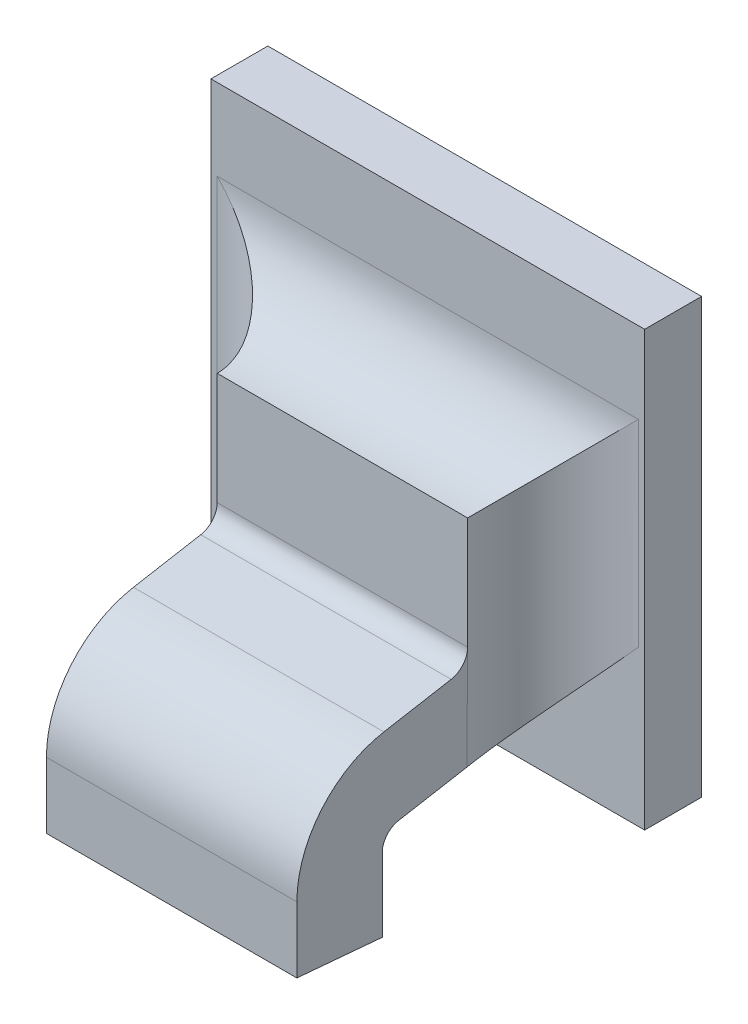
ISO-10303-21;
HEADER;
FILE_DESCRIPTION(('STEP AP214'),'2;1');
FILE_NAME('part.step','',(''),(''),'','','');
FILE_SCHEMA(('AUTOMOTIVE_DESIGN { 1 0 10303 214 1 1 1 1 }'));
ENDSEC;
DATA;
#1=APPLICATION_CONTEXT('core data for automotive mechanical design processes');
#2=APPLICATION_PROTOCOL_DEFINITION('international standard','automotive_design',2000,#1);
#3=PRODUCT_CONTEXT('',#1,'mechanical');
#4=PRODUCT('Part','Part','',(#3));
#5=PRODUCT_RELATED_PRODUCT_CATEGORY('part','',(#4));
#6=PRODUCT_DEFINITION_FORMATION('','',#4);
#7=PRODUCT_DEFINITION_CONTEXT('part definition',#1,'design');
#8=PRODUCT_DEFINITION('design','',#6,#7);
#9=PRODUCT_DEFINITION_SHAPE('','',#8);
#10=(LENGTH_UNIT() NAMED_UNIT(*) SI_UNIT(.MILLI.,.METRE.));
#11=(NAMED_UNIT(*) PLANE_ANGLE_UNIT() SI_UNIT($,.RADIAN.));
#12=(NAMED_UNIT(*) SI_UNIT($,.STERADIAN.) SOLID_ANGLE_UNIT());
#13=UNCERTAINTY_MEASURE_WITH_UNIT(LENGTH_MEASURE(1.E-05),#10,'distance_accuracy_value','');
#14=(GEOMETRIC_REPRESENTATION_CONTEXT(3) GLOBAL_UNCERTAINTY_ASSIGNED_CONTEXT((#13)) GLOBAL_UNIT_ASSIGNED_CONTEXT((#10,
#11,#12)) REPRESENTATION_CONTEXT('',''));
#15=CARTESIAN_POINT('',(0.,0.,0.));
#16=DIRECTION('',(0.,0.,1.));
#17=DIRECTION('',(1.,0.,0.));
#18=AXIS2_PLACEMENT_3D('',#15,#16,#17);
#19=CARTESIAN_POINT('',(0.822556400239721,-0.409025815001354,0.0757361902758917));
#20=DIRECTION('',(0.,0.984807753012208,0.17364817766693));
#21=DIRECTION('',(0.,-0.17364817766693,0.984807753012208));
#22=AXIS2_PLACEMENT_3D('',#19,#20,#21);
#23=PLANE('',#22);
#24=DIRECTION('',(0.,-0.1736481776671,0.984807753012178));
#25=VECTOR('',#24,1.);
#26=CARTESIAN_POINT('',(0.840745376617674,-0.409066843165544,0.0759688725575585));
#27=LINE('',#26,#25);
#28=CARTESIAN_POINT('',(0.840745376617674,-0.409066843165544,0.0759688725575584));
#29=VERTEX_POINT('',#28);
#30=CARTESIAN_POINT('',(0.840745376617674,-0.409887406449358,0.0806225181908947));
#31=VERTEX_POINT('',#30);
#32=EDGE_CURVE('E149',#29,#31,#27,.T.);
#33=ORIENTED_EDGE('',*,*,#32,.F.);
#34=DIRECTION('',(1.,0.,0.));
#35=VECTOR('',#34,1.);
#36=CARTESIAN_POINT('',(0.841611518349957,-0.409066843165544,0.0759688725575585));
#37=LINE('',#36,#35);
#38=CARTESIAN_POINT('',(0.823422541972004,-0.409066843165544,0.0759688725575584));
#39=VERTEX_POINT('',#38);
#40=EDGE_CURVE('E145',#29,#39,#37,.F.);
#41=ORIENTED_EDGE('',*,*,#40,.T.);
#42=DIRECTION('',(0.,-0.1736481776671,0.984807753012178));
#43=VECTOR('',#42,1.);
#44=CARTESIAN_POINT('',(0.823422541972004,-0.409066843165544,0.0759688725575585));
#45=LINE('',#44,#43);
#46=CARTESIAN_POINT('',(0.823422541972004,-0.409887406449358,0.0806225181908947));
#47=VERTEX_POINT('',#46);
#48=EDGE_CURVE('E187',#39,#47,#45,.T.);
#49=ORIENTED_EDGE('',*,*,#48,.T.);
#50=DIRECTION('',(1.,0.,0.));
#51=VECTOR('',#50,1.);
#52=CARTESIAN_POINT('',(0.841611518349957,-0.409887406449358,0.0806225181908942));
#53=LINE('',#52,#51);
#54=EDGE_CURVE('E228',#31,#47,#53,.F.);
#55=ORIENTED_EDGE('',*,*,#54,.F.);
#56=EDGE_LOOP('',(#33,#41,#49,#55));
#57=FACE_BOUND('',#56,.T.);
#58=ADVANCED_FACE('F17',(#57),#23,.T.);
#59=CARTESIAN_POINT('',(0.841611518349957,-0.417060218823659,0.0793577578417452));
#60=DIRECTION('',(1.,0.,0.));
#61=DIRECTION('',(0.,1.,0.));
#62=AXIS2_PLACEMENT_3D('',#59,#60,#61);
#63=CYLINDRICAL_SURFACE('',#62,0.00728346456692914);
#64=CARTESIAN_POINT('',(0.840745376617674,-0.417060218823659,0.0793577578417452));
#65=DIRECTION('',(1.,0.,0.));
#66=DIRECTION('',(0.,1.,0.));
#67=AXIS2_PLACEMENT_3D('',#64,#65,#66);
#68=CIRCLE('',#67,0.00728346456692914);
#69=CARTESIAN_POINT('',(0.840745376617674,-0.417060218823659,0.0866412224086743));
#70=VERTEX_POINT('',#69);
#71=EDGE_CURVE('E202',#31,#70,#68,.T.);
#72=ORIENTED_EDGE('',*,*,#71,.F.);
#73=ORIENTED_EDGE('',*,*,#54,.T.);
#74=CARTESIAN_POINT('',(0.823422541972004,-0.417060218823659,0.0793577578417452));
#75=DIRECTION('',(1.,0.,0.));
#76=DIRECTION('',(0.,1.,0.));
#77=AXIS2_PLACEMENT_3D('',#74,#75,#76);
#78=CIRCLE('',#77,0.00728346456692914);
#79=CARTESIAN_POINT('',(0.823422541972004,-0.417060218823659,0.0866412224086743));
#80=VERTEX_POINT('',#79);
#81=EDGE_CURVE('E184',#47,#80,#78,.T.);
#82=ORIENTED_EDGE('',*,*,#81,.T.);
#83=DIRECTION('',(1.,0.,0.));
#84=VECTOR('',#83,1.);
#85=CARTESIAN_POINT('',(0.822556400239721,-0.417060218823659,0.0866412224086743));
#86=LINE('',#85,#84);
#87=EDGE_CURVE('E224',#70,#80,#86,.F.);
#88=ORIENTED_EDGE('',*,*,#87,.F.);
#89=EDGE_LOOP('',(#72,#73,#82,#88));
#90=FACE_BOUND('',#89,.T.);
#91=ADVANCED_FACE('F278',(#90),#63,.T.);
#92=CARTESIAN_POINT('',(0.822556400239721,-0.416832209296573,0.0866412224086743));
#93=DIRECTION('',(0.,0.,1.));
#94=DIRECTION('',(0.,-1.,0.));
#95=AXIS2_PLACEMENT_3D('',#92,#93,#94);
#96=PLANE('',#95);
#97=ORIENTED_EDGE('',*,*,#87,.T.);
#98=DIRECTION('',(0.,1.,0.));
#99=VECTOR('',#98,1.);
#100=CARTESIAN_POINT('',(0.823422541972004,-0.422858437205813,0.0866412224086743));
#101=LINE('',#100,#99);
#102=CARTESIAN_POINT('',(0.823422541972004,-0.421620409365384,0.0866412224086743));
#103=VERTEX_POINT('',#102);
#104=EDGE_CURVE('E181',#80,#103,#101,.F.);
#105=ORIENTED_EDGE('',*,*,#104,.T.);
#106=DIRECTION('',(1.,0.,0.));
#107=VECTOR('',#106,1.);
#108=CARTESIAN_POINT('',(0.832083959294839,-0.421620409365383,0.0866412224086742));
#109=LINE('',#108,#107);
#110=CARTESIAN_POINT('',(0.840745376617674,-0.421620409365384,0.0866412224086743));
#111=VERTEX_POINT('',#110);
#112=EDGE_CURVE('E215',#103,#111,#109,.T.);
#113=ORIENTED_EDGE('',*,*,#112,.T.);
#114=DIRECTION('',(0.,1.,0.));
#115=VECTOR('',#114,1.);
#116=CARTESIAN_POINT('',(0.840745376617674,-0.422858437205813,0.0866412224086743));
#117=LINE('',#116,#115);
#118=EDGE_CURVE('E200',#70,#111,#117,.F.);
#119=ORIENTED_EDGE('',*,*,#118,.F.);
#120=EDGE_LOOP('',(#97,#105,#113,#119));
#121=FACE_BOUND('',#120,.T.);
#122=ADVANCED_FACE('F282',(#121),#96,.T.);
#123=CARTESIAN_POINT('',(0.832083959294839,-0.421652497123847,0.0862744576511551));
#124=DIRECTION('',(0.,0.99619469809174,-0.0871557427477276));
#125=DIRECTION('',(0.,0.0871557427477276,0.99619469809174));
#126=AXIS2_PLACEMENT_3D('',#123,#124,#125);
#127=PLANE('',#126);
#128=DIRECTION('',(0.,-0.0871557427476629,-0.996194698091745));
#129=VECTOR('',#128,1.);
#130=CARTESIAN_POINT('',(0.840745376617674,-0.421620409365384,0.0866412224086743));
#131=LINE('',#130,#129);
#132=CARTESIAN_POINT('',(0.840745376617674,-0.422137074701167,0.0807357105976507));
#133=VERTEX_POINT('',#132);
#134=EDGE_CURVE('E197',#111,#133,#131,.T.);
#135=ORIENTED_EDGE('',*,*,#134,.F.);
#136=ORIENTED_EDGE('',*,*,#112,.F.);
#137=DIRECTION('',(0.,-0.0871557427476629,-0.996194698091745));
#138=VECTOR('',#137,1.);
#139=CARTESIAN_POINT('',(0.823422541972004,-0.421620409365384,0.0866412224086743));
#140=LINE('',#139,#138);
#141=CARTESIAN_POINT('',(0.823422541972004,-0.422137074701167,0.0807357105976507));
#142=VERTEX_POINT('',#141);
#143=EDGE_CURVE('E178',#103,#142,#140,.T.);
#144=ORIENTED_EDGE('',*,*,#143,.T.);
#145=DIRECTION('',(1.,0.,0.));
#146=VECTOR('',#145,1.);
#147=CARTESIAN_POINT('',(0.822556400239721,-0.422137074701167,0.0807357105976507));
#148=LINE('',#147,#146);
#149=EDGE_CURVE('E212',#142,#133,#148,.T.);
#150=ORIENTED_EDGE('',*,*,#149,.T.);
#151=EDGE_LOOP('',(#135,#136,#144,#150));
#152=FACE_BOUND('',#151,.T.);
#153=ADVANCED_FACE('F286',(#152),#127,.F.);
#154=CARTESIAN_POINT('',(0.822556400239721,-0.416806376029784,0.0807357105976507));
#155=DIRECTION('',(0.,0.,1.));
#156=DIRECTION('',(0.,-1.,0.));
#157=AXIS2_PLACEMENT_3D('',#154,#155,#156);
#158=PLANE('',#157);
#159=ORIENTED_EDGE('',*,*,#149,.F.);
#160=DIRECTION('',(0.,1.,0.));
#161=VECTOR('',#160,1.);
#162=CARTESIAN_POINT('',(0.823422541972004,-0.422858437205813,0.0807357105976507));
#163=LINE('',#162,#161);
#164=CARTESIAN_POINT('',(0.823422541972004,-0.417060218823659,0.0807357105976507));
#165=VERTEX_POINT('',#164);
#166=EDGE_CURVE('E175',#142,#165,#163,.T.);
#167=ORIENTED_EDGE('',*,*,#166,.T.);
#168=DIRECTION('',(1.,0.,0.));
#169=VECTOR('',#168,1.);
#170=CARTESIAN_POINT('',(0.841611518349957,-0.417060218823659,0.0807357105976507));
#171=LINE('',#170,#169);
#172=CARTESIAN_POINT('',(0.840745376617674,-0.417060218823659,0.0807357105976507));
#173=VERTEX_POINT('',#172);
#174=EDGE_CURVE('E207',#165,#173,#171,.T.);
#175=ORIENTED_EDGE('',*,*,#174,.T.);
#176=DIRECTION('',(0.,1.,0.));
#177=VECTOR('',#176,1.);
#178=CARTESIAN_POINT('',(0.840745376617674,-0.422858437205813,0.0807357105976507));
#179=LINE('',#178,#177);
#180=EDGE_CURVE('E194',#133,#173,#179,.T.);
#181=ORIENTED_EDGE('',*,*,#180,.F.);
#182=EDGE_LOOP('',(#159,#167,#175,#181));
#183=FACE_BOUND('',#182,.T.);
#184=ADVANCED_FACE('F290',(#183),#158,.F.);
#185=CARTESIAN_POINT('',(0.841611518349957,-0.417060218823659,0.0793577578417452));
#186=DIRECTION('',(1.,0.,0.));
#187=DIRECTION('',(0.,1.,0.));
#188=AXIS2_PLACEMENT_3D('',#185,#186,#187);
#189=CYLINDRICAL_SURFACE('',#188,0.00137795275590551);
#190=DIRECTION('',(1.,0.,0.));
#191=VECTOR('',#190,1.);
#192=CARTESIAN_POINT('',(0.822556400239721,-0.415703200266359,0.0795970368267193));
#193=LINE('',#192,#191);
#194=CARTESIAN_POINT('',(0.823422541972004,-0.415703200266359,0.0795970368267193));
#195=VERTEX_POINT('',#194);
#196=CARTESIAN_POINT('',(0.840745376617674,-0.415703200266359,0.0795970368267193));
#197=VERTEX_POINT('',#196);
#198=EDGE_CURVE('E191',#195,#197,#193,.T.);
#199=ORIENTED_EDGE('',*,*,#198,.T.);
#200=CARTESIAN_POINT('',(0.840745376617674,-0.417060218823659,0.0793577578417452));
#201=DIRECTION('',(1.,0.,0.));
#202=DIRECTION('',(0.,1.,0.));
#203=AXIS2_PLACEMENT_3D('',#200,#201,#202);
#204=CIRCLE('',#203,0.00137795275590551);
#205=EDGE_CURVE('E196',#173,#197,#204,.F.);
#206=ORIENTED_EDGE('',*,*,#205,.F.);
#207=ORIENTED_EDGE('',*,*,#174,.F.);
#208=CARTESIAN_POINT('',(0.823422541972004,-0.417060218823659,0.0793577578417452));
#209=DIRECTION('',(1.,0.,0.));
#210=DIRECTION('',(0.,1.,0.));
#211=AXIS2_PLACEMENT_3D('',#208,#209,#210);
#212=CIRCLE('',#211,0.00137795275590551);
#213=EDGE_CURVE('E172',#165,#195,#212,.F.);
#214=ORIENTED_EDGE('',*,*,#213,.T.);
#215=EDGE_LOOP('',(#199,#206,#207,#214));
#216=FACE_BOUND('',#215,.T.);
#217=ADVANCED_FACE('F294',(#216),#189,.F.);
#218=CARTESIAN_POINT('',(0.841611518349957,-0.407709824608244,0.0762081515425326));
#219=DIRECTION('',(1.,0.,0.));
#220=DIRECTION('',(0.,1.,0.));
#221=AXIS2_PLACEMENT_3D('',#218,#219,#220);
#222=CYLINDRICAL_SURFACE('',#221,0.00137795275590552);
#223=ORIENTED_EDGE('',*,*,#40,.F.);
#224=CARTESIAN_POINT('',(0.840745376617674,-0.407709824608244,0.0762081515425326));
#225=DIRECTION('',(1.,0.,0.));
#226=DIRECTION('',(0.,1.,0.));
#227=AXIS2_PLACEMENT_3D('',#224,#225,#226);
#228=CIRCLE('',#227,0.00137795275590552);
#229=CARTESIAN_POINT('',(0.840745376617674,-0.407709824608244,0.0748301987866271));
#230=VERTEX_POINT('',#229);
#231=EDGE_CURVE('E20',#230,#29,#228,.F.);
#232=ORIENTED_EDGE('',*,*,#231,.F.);
#233=DIRECTION('',(1.,0.,0.));
#234=VECTOR('',#233,1.);
#235=CARTESIAN_POINT('',(0.822556400239721,-0.407709824608244,0.0748301987866271));
#236=LINE('',#235,#234);
#237=CARTESIAN_POINT('',(0.823422541972004,-0.407709824608244,0.0748301987866271));
#238=VERTEX_POINT('',#237);
#239=EDGE_CURVE('E127',#238,#230,#236,.T.);
#240=ORIENTED_EDGE('',*,*,#239,.F.);
#241=CARTESIAN_POINT('',(0.823422541972004,-0.407709824608244,0.0762081515425326));
#242=DIRECTION('',(1.,0.,0.));
#243=DIRECTION('',(0.,1.,0.));
#244=AXIS2_PLACEMENT_3D('',#241,#242,#243);
#245=CIRCLE('',#244,0.00137795275590552);
#246=EDGE_CURVE('E139',#238,#39,#245,.F.);
#247=ORIENTED_EDGE('',*,*,#246,.T.);
#248=EDGE_LOOP('',(#223,#232,#240,#247));
#249=FACE_BOUND('',#248,.T.);
#250=ADVANCED_FACE('F143',(#249),#222,.F.);
#251=CARTESIAN_POINT('',(0.840745376617674,-0.422858437205813,0.0742396476055247));
#252=DIRECTION('',(1.,0.,0.));
#253=DIRECTION('',(0.,1.,0.));
#254=AXIS2_PLACEMENT_3D('',#251,#252,#253);
#255=PLANE('',#254);
#256=ORIENTED_EDGE('',*,*,#205,.T.);
#257=DIRECTION('',(0.,-0.17364817766693,0.984807753012208));
#258=VECTOR('',#257,1.);
#259=CARTESIAN_POINT('',(0.840745376617674,-0.414841608818355,0.0747107089117169));
#260=LINE('',#259,#258);
#261=CARTESIAN_POINT('',(0.840745376617674,-0.414872195780549,0.0748867949900054));
#262=VERTEX_POINT('',#261);
#263=EDGE_CURVE('E162',#197,#262,#260,.F.);
#264=ORIENTED_EDGE('',*,*,#263,.T.);
#265=DIRECTION('',(0.,1.,0.));
#266=VECTOR('',#265,1.);
#267=CARTESIAN_POINT('',(0.840745376617673,-0.393021334230709,0.0748301987866271));
#268=LINE('',#267,#266);
#269=EDGE_CURVE('E138',#262,#230,#268,.T.);
#270=ORIENTED_EDGE('',*,*,#269,.T.);
#271=ORIENTED_EDGE('',*,*,#231,.T.);
#272=ORIENTED_EDGE('',*,*,#32,.T.);
#273=ORIENTED_EDGE('',*,*,#71,.T.);
#274=ORIENTED_EDGE('',*,*,#118,.T.);
#275=ORIENTED_EDGE('',*,*,#134,.T.);
#276=ORIENTED_EDGE('',*,*,#180,.T.);
#277=EDGE_LOOP('',(#256,#264,#270,#271,#272,#273,#274,#275,#276));
#278=FACE_BOUND('',#277,.T.);
#279=ADVANCED_FACE('F160',(#278),#255,.T.);
#280=CARTESIAN_POINT('',(0.822556400239721,-0.414841608818355,0.0747107089117169));
#281=DIRECTION('',(0.,0.984807753012208,0.17364817766693));
#282=DIRECTION('',(0.,-0.17364817766693,0.984807753012208));
#283=AXIS2_PLACEMENT_3D('',#280,#281,#282);
#284=PLANE('',#283);
#285=DIRECTION('',(1.,0.,0.));
#286=VECTOR('',#285,1.);
#287=CARTESIAN_POINT('',(0.848107581342083,-0.414882636982546,0.0749433911933838));
#288=LINE('',#287,#286);
#289=CARTESIAN_POINT('',(0.823422541972004,-0.414872195780549,0.0748867949900054));
#290=VERTEX_POINT('',#289);
#291=EDGE_CURVE('E243',#262,#290,#288,.F.);
#292=ORIENTED_EDGE('',*,*,#291,.F.);
#293=ORIENTED_EDGE('',*,*,#263,.F.);
#294=ORIENTED_EDGE('',*,*,#198,.F.);
#295=DIRECTION('',(0.,0.173648177666888,-0.984807753012215));
#296=VECTOR('',#295,1.);
#297=CARTESIAN_POINT('',(0.823422541972004,-0.415703200266359,0.0795970368267193));
#298=LINE('',#297,#296);
#299=EDGE_CURVE('E169',#195,#290,#298,.T.);
#300=ORIENTED_EDGE('',*,*,#299,.T.);
#301=EDGE_LOOP('',(#292,#293,#294,#300));
#302=FACE_BOUND('',#301,.T.);
#303=ADVANCED_FACE('F297',(#302),#284,.F.);
#304=CARTESIAN_POINT('',(0.823422541972004,-0.422858437205813,0.0742396476055247));
#305=DIRECTION('',(1.,0.,0.));
#306=DIRECTION('',(0.,1.,0.));
#307=AXIS2_PLACEMENT_3D('',#304,#305,#306);
#308=PLANE('',#307);
#309=DIRECTION('',(0.,-1.,0.));
#310=VECTOR('',#309,1.);
#311=CARTESIAN_POINT('',(0.823422541972005,-0.449179464483494,0.074830198786627));
#312=LINE('',#311,#310);
#313=EDGE_CURVE('E239',#238,#290,#312,.T.);
#314=ORIENTED_EDGE('',*,*,#313,.T.);
#315=ORIENTED_EDGE('',*,*,#299,.F.);
#316=ORIENTED_EDGE('',*,*,#213,.F.);
#317=ORIENTED_EDGE('',*,*,#166,.F.);
#318=ORIENTED_EDGE('',*,*,#143,.F.);
#319=ORIENTED_EDGE('',*,*,#104,.F.);
#320=ORIENTED_EDGE('',*,*,#81,.F.);
#321=ORIENTED_EDGE('',*,*,#48,.F.);
#322=ORIENTED_EDGE('',*,*,#246,.F.);
#323=EDGE_LOOP('',(#314,#315,#316,#317,#318,#319,#320,#321,#322));
#324=FACE_BOUND('',#323,.T.);
#325=ADVANCED_FACE('F300',(#324),#308,.F.);
#326=CARTESIAN_POINT('',(0.822556400239721,-0.3995797181308,0.0748301987866271));
#327=DIRECTION('',(0.,0.,1.));
#328=DIRECTION('',(0.,-1.,0.));
#329=AXIS2_PLACEMENT_3D('',#326,#327,#328);
#330=PLANE('',#329);
#331=DIRECTION('',(0.,1.,0.));
#332=VECTOR('',#331,1.);
#333=CARTESIAN_POINT('',(0.840745376617673,-0.393021334230709,0.0748301987866271));
#334=LINE('',#333,#332);
#335=CARTESIAN_POINT('',(0.840745376617673,-0.399966866058297,0.0748301987866271));
#336=VERTEX_POINT('',#335);
#337=EDGE_CURVE('E132',#230,#336,#334,.T.);
#338=ORIENTED_EDGE('',*,*,#337,.T.);
#339=DIRECTION('',(-1.,0.,0.));
#340=VECTOR('',#339,1.);
#341=CARTESIAN_POINT('',(0.816060337247595,-0.399966866058297,0.0748301987866271));
#342=LINE('',#341,#340);
#343=CARTESIAN_POINT('',(0.823422541972005,-0.399966866058297,0.0748301987866271));
#344=VERTEX_POINT('',#343);
#345=EDGE_CURVE('E237',#336,#344,#342,.T.);
#346=ORIENTED_EDGE('',*,*,#345,.T.);
#347=DIRECTION('',(0.,-1.,0.));
#348=VECTOR('',#347,1.);
#349=CARTESIAN_POINT('',(0.823422541972005,-0.449179464483494,0.074830198786627));
#350=LINE('',#349,#348);
#351=EDGE_CURVE('E134',#344,#238,#350,.T.);
#352=ORIENTED_EDGE('',*,*,#351,.T.);
#353=ORIENTED_EDGE('',*,*,#239,.T.);
#354=EDGE_LOOP('',(#338,#346,#352,#353));
#355=FACE_BOUND('',#354,.T.);
#356=ADVANCED_FACE('F129',(#355),#330,.T.);
#357=CARTESIAN_POINT('',(0.846650888428697,-0.393021334230709,0.0748301987866271));
#358=DIRECTION('',(0.,1.,0.));
#359=DIRECTION('',(-1.,0.,0.));
#360=AXIS2_PLACEMENT_3D('',#357,#358,#359);
#361=CYLINDRICAL_SURFACE('',#360,0.00590551181102362);
#362=DIRECTION('',(0.,-1.,0.));
#363=VECTOR('',#362,1.);
#364=CARTESIAN_POINT('',(0.846650888428697,-0.386950817143496,0.0689246869756034));
#365=LINE('',#364,#363);
#366=CARTESIAN_POINT('',(0.846650888428697,-0.394061354247273,0.0689246869756034));
#367=VERTEX_POINT('',#366);
#368=CARTESIAN_POINT('',(0.846650888428697,-0.407709824608244,0.0689246869756034));
#369=VERTEX_POINT('',#368);
#370=EDGE_CURVE('E236',#367,#369,#365,.T.);
#371=ORIENTED_EDGE('',*,*,#370,.F.);
#372=CARTESIAN_POINT('',(0.846650888428697,-0.394061354247273,0.0748301987866271));
#373=DIRECTION('',(-0.707106781186547,0.707106781186548,0.));
#374=DIRECTION('',(0.707106781186548,0.707106781186547,0.));
#375=AXIS2_PLACEMENT_3D('',#372,#373,#374);
#376=ELLIPSE('',#375,0.0083516548959041,0.00590551181102362);
#377=EDGE_CURVE('E156',#367,#336,#376,.T.);
#378=ORIENTED_EDGE('',*,*,#377,.T.);
#379=ORIENTED_EDGE('',*,*,#337,.F.);
#380=ORIENTED_EDGE('',*,*,#269,.F.);
#381=CARTESIAN_POINT('',(0.840745647396675,-0.414872418925753,0.0748867512278158));
#382=CARTESIAN_POINT('',(0.840742426597774,-0.414817534883798,0.0745867226896992));
#383=CARTESIAN_POINT('',(0.840762764717073,-0.414743102049647,0.0742912180435631));
#384=CARTESIAN_POINT('',(0.840843797330654,-0.414561218717932,0.0737192521976587));
#385=CARTESIAN_POINT('',(0.840904113821746,-0.414454082507667,0.073442639142952));
#386=CARTESIAN_POINT('',(0.841058198198209,-0.414212160110653,0.0729136983352979));
#387=CARTESIAN_POINT('',(0.841151824927203,-0.414077491604489,0.0726612737245141));
#388=CARTESIAN_POINT('',(0.841366072521191,-0.413785592919213,0.0721816323385189));
#389=CARTESIAN_POINT('',(0.841486762280983,-0.413628305532027,0.0719544821529173));
#390=CARTESIAN_POINT('',(0.841817110992378,-0.413210355493482,0.0714163132371127));
#391=CARTESIAN_POINT('',(0.842040521572931,-0.412938266512525,0.0711225918397621));
#392=CARTESIAN_POINT('',(0.842520298728847,-0.412366852005353,0.0705945092326559));
#393=CARTESIAN_POINT('',(0.842776741388518,-0.41206746408041,0.0703602888968061));
#394=CARTESIAN_POINT('',(0.843412248246951,-0.411334595021275,0.0698701186002405));
#395=CARTESIAN_POINT('',(0.843801168483127,-0.410893014396456,0.0696391000518475));
#396=CARTESIAN_POINT('',(0.844601142787128,-0.409991989295698,0.0692744135071735));
#397=CARTESIAN_POINT('',(0.845012181353002,-0.409532557392268,0.069140678258787));
#398=CARTESIAN_POINT('',(0.845713565203828,-0.408751184121972,0.0689922627689179));
#399=CARTESIAN_POINT('',(0.846001338597921,-0.408431306043267,0.0689533996467431));
#400=CARTESIAN_POINT('',(0.846410047822815,-0.407977291603917,0.0689283735464717));
#401=CARTESIAN_POINT('',(0.846530475434509,-0.407843550361138,0.0689246971321213));
#402=CARTESIAN_POINT('',(0.846650888428697,-0.407709824608244,0.0689246869756035));
#403=B_SPLINE_CURVE_WITH_KNOTS('',3,(#381,#382,#383,#384,#385,#386,#387,#388,#389,#390,#391,
#392,#393,#394,#395,#396,#397,#398,#399,#400,#401,#402),.UNSPECIFIED.,.F.,.F.,(4,2,2,2,2,2,2,2,
2,2,4),(0.,0.000911854640629307,0.00181520821824951,0.00271477844400083,0.00361666525652744,
0.00498448467541982,0.00635551296143176,0.0082419467971581,0.0101270752955223,
0.0114210586750924,0.0119609297477214),.UNSPECIFIED.);
#404=EDGE_CURVE('E157',#369,#262,#403,.F.);
#405=ORIENTED_EDGE('',*,*,#404,.F.);
#406=EDGE_LOOP('',(#371,#378,#379,#380,#405));
#407=FACE_BOUND('',#406,.T.);
#408=ADVANCED_FACE('F153',(#407),#361,.F.);
#409=CARTESIAN_POINT('',(0.848107581342083,-0.407709824608244,0.0762081515425326));
#410=DIRECTION('',(1.,0.,0.));
#411=DIRECTION('',(0.,1.,0.));
#412=AXIS2_PLACEMENT_3D('',#409,#410,#411);
#413=CYLINDRICAL_SURFACE('',#412,0.00728346456692914);
#414=ORIENTED_EDGE('',*,*,#404,.T.);
#415=ORIENTED_EDGE('',*,*,#291,.T.);
#416=CARTESIAN_POINT('',(0.823422271193003,-0.414872418925753,0.0748867512278158));
#417=CARTESIAN_POINT('',(0.823425491991904,-0.414817534883798,0.0745867226896991));
#418=CARTESIAN_POINT('',(0.823405153872605,-0.414743102049647,0.0742912180435631));
#419=CARTESIAN_POINT('',(0.823324121259024,-0.414561218717932,0.0737192521976587));
#420=CARTESIAN_POINT('',(0.823263804767932,-0.414454082507667,0.0734426391429519));
#421=CARTESIAN_POINT('',(0.823109720391469,-0.414212160110653,0.0729136983352979));
#422=CARTESIAN_POINT('',(0.823016093662476,-0.414077491604489,0.0726612737245141));
#423=CARTESIAN_POINT('',(0.822801846068487,-0.413785592919213,0.0721816323385189));
#424=CARTESIAN_POINT('',(0.822681156308695,-0.413628305532027,0.0719544821529173));
#425=CARTESIAN_POINT('',(0.8223508075973,-0.413210355493482,0.0714163132371128));
#426=CARTESIAN_POINT('',(0.822127397016747,-0.412938266512525,0.0711225918397621));
#427=CARTESIAN_POINT('',(0.821647619860831,-0.412366852005353,0.0705945092326559));
#428=CARTESIAN_POINT('',(0.82139117720116,-0.41206746408041,0.0703602888968061));
#429=CARTESIAN_POINT('',(0.820755670342727,-0.411334595021275,0.0698701186002404));
#430=CARTESIAN_POINT('',(0.820366750106551,-0.410893014396456,0.0696391000518475));
#431=CARTESIAN_POINT('',(0.81956677580255,-0.409991989295698,0.0692744135071735));
#432=CARTESIAN_POINT('',(0.819155737236676,-0.409532557392268,0.0691406782587869));
#433=CARTESIAN_POINT('',(0.81845435338585,-0.408751184121971,0.0689922627689179));
#434=CARTESIAN_POINT('',(0.818166579991758,-0.408431306043267,0.0689533996467431));
#435=CARTESIAN_POINT('',(0.817757870766864,-0.407977291603917,0.0689283735464716));
#436=CARTESIAN_POINT('',(0.817637443155169,-0.407843550361138,0.0689246971321213));
#437=CARTESIAN_POINT('',(0.817517030160981,-0.407709824608244,0.0689246869756034));
#438=B_SPLINE_CURVE_WITH_KNOTS('',3,(#416,#417,#418,#419,#420,#421,#422,#423,#424,#425,#426,
#427,#428,#429,#430,#431,#432,#433,#434,#435,#436,#437),.UNSPECIFIED.,.F.,.F.,(4,2,2,2,2,2,2,2,
2,2,4),(0.,0.000911854640629281,0.00181520821824949,0.00271477844400081,0.00361666525652741,
0.00498448467541974,0.0063555129614317,0.008241946797158,0.0101270752955222,0.0114210586750924,
0.0119609297477214),.UNSPECIFIED.);
#439=CARTESIAN_POINT('',(0.817517030160981,-0.407709824608244,0.0689246869756034));
#440=VERTEX_POINT('',#439);
#441=EDGE_CURVE('E240',#290,#440,#438,.T.);
#442=ORIENTED_EDGE('',*,*,#441,.T.);
#443=DIRECTION('',(1.,0.,0.));
#444=VECTOR('',#443,1.);
#445=CARTESIAN_POINT('',(0.815583959294839,-0.407709824608244,0.0689246869756034));
#446=LINE('',#445,#444);
#447=EDGE_CURVE('E310',#369,#440,#446,.F.);
#448=ORIENTED_EDGE('',*,*,#447,.F.);
#449=EDGE_LOOP('',(#414,#415,#442,#448));
#450=FACE_BOUND('',#449,.T.);
#451=ADVANCED_FACE('F255',(#450),#413,.T.);
#452=CARTESIAN_POINT('',(0.817517030160981,-0.449179464483494,0.074830198786627));
#453=DIRECTION('',(0.,-1.,0.));
#454=DIRECTION('',(1.,0.,0.));
#455=AXIS2_PLACEMENT_3D('',#452,#453,#454);
#456=CYLINDRICAL_SURFACE('',#455,0.00590551181102362);
#457=ORIENTED_EDGE('',*,*,#351,.F.);
#458=CARTESIAN_POINT('',(0.817517030160981,-0.394061354247273,0.0748301987866271));
#459=DIRECTION('',(-0.707106781186548,-0.707106781186547,0.));
#460=DIRECTION('',(0.707106781186547,-0.707106781186548,0.));
#461=AXIS2_PLACEMENT_3D('',#458,#459,#460);
#462=ELLIPSE('',#461,0.0083516548959041,0.00590551181102362);
#463=CARTESIAN_POINT('',(0.817517030160981,-0.394061354247273,0.0689246869756034));
#464=VERTEX_POINT('',#463);
#465=EDGE_CURVE('E233',#344,#464,#462,.F.);
#466=ORIENTED_EDGE('',*,*,#465,.T.);
#467=DIRECTION('',(0.,-1.,0.));
#468=VECTOR('',#467,1.);
#469=CARTESIAN_POINT('',(0.817517030160981,-0.386950817143496,0.0689246869756034));
#470=LINE('',#469,#468);
#471=EDGE_CURVE('E312',#440,#464,#470,.F.);
#472=ORIENTED_EDGE('',*,*,#471,.F.);
#473=ORIENTED_EDGE('',*,*,#441,.F.);
#474=ORIENTED_EDGE('',*,*,#313,.F.);
#475=EDGE_LOOP('',(#457,#466,#472,#473,#474));
#476=FACE_BOUND('',#475,.T.);
#477=ADVANCED_FACE('F252',(#476),#456,.F.);
#478=CARTESIAN_POINT('',(0.816060337247595,-0.394061354247273,0.0748301987866271));
#479=DIRECTION('',(-1.,0.,0.));
#480=DIRECTION('',(0.,-1.,0.));
#481=AXIS2_PLACEMENT_3D('',#478,#479,#480);
#482=CYLINDRICAL_SURFACE('',#481,0.00590551181102362);
#483=ORIENTED_EDGE('',*,*,#345,.F.);
#484=ORIENTED_EDGE('',*,*,#377,.F.);
#485=DIRECTION('',(1.,0.,0.));
#486=VECTOR('',#485,1.);
#487=CARTESIAN_POINT('',(0.815583959294839,-0.394061354247273,0.0689246869756034));
#488=LINE('',#487,#486);
#489=EDGE_CURVE('E320',#464,#367,#488,.T.);
#490=ORIENTED_EDGE('',*,*,#489,.F.);
#491=ORIENTED_EDGE('',*,*,#465,.F.);
#492=EDGE_LOOP('',(#483,#484,#490,#491));
#493=FACE_BOUND('',#492,.T.);
#494=ADVANCED_FACE('F382',(#493),#482,.F.);
#495=CARTESIAN_POINT('',(0.815583959294839,-0.386950817143496,0.0689246869756034));
#496=DIRECTION('',(0.,0.,1.));
#497=DIRECTION('',(0.,-1.,0.));
#498=AXIS2_PLACEMENT_3D('',#495,#496,#497);
#499=PLANE('',#498);
#500=ORIENTED_EDGE('',*,*,#471,.T.);
#501=ORIENTED_EDGE('',*,*,#489,.T.);
#502=ORIENTED_EDGE('',*,*,#370,.T.);
#503=ORIENTED_EDGE('',*,*,#447,.T.);
#504=EDGE_LOOP('',(#500,#501,#502,#503));
#505=FACE_BOUND('',#504,.T.);
#506=DIRECTION('',(0.,-1.,0.));
#507=VECTOR('',#506,1.);
#508=CARTESIAN_POINT('',(0.847083959294839,-0.386950817143496,0.0689246869756034));
#509=LINE('',#508,#507);
#510=CARTESIAN_POINT('',(0.847083959294839,-0.418450817143496,0.0689246869756034));
#511=VERTEX_POINT('',#510);
#512=CARTESIAN_POINT('',(0.847083959294839,-0.388450817143496,0.0689246869756034));
#513=VERTEX_POINT('',#512);
#514=EDGE_CURVE('E332',#511,#513,#509,.F.);
#515=ORIENTED_EDGE('',*,*,#514,.T.);
#516=DIRECTION('',(1.,0.,0.));
#517=VECTOR('',#516,1.);
#518=CARTESIAN_POINT('',(0.815583959294839,-0.388450817143496,0.0689246869756034));
#519=LINE('',#518,#517);
#520=CARTESIAN_POINT('',(0.817083959294839,-0.388450817143496,0.0689246869756034));
#521=VERTEX_POINT('',#520);
#522=EDGE_CURVE('E337',#513,#521,#519,.F.);
#523=ORIENTED_EDGE('',*,*,#522,.T.);
#524=DIRECTION('',(0.,1.,0.));
#525=VECTOR('',#524,1.);
#526=CARTESIAN_POINT('',(0.817083959294839,-0.419950817143496,0.0689246869756034));
#527=LINE('',#526,#525);
#528=CARTESIAN_POINT('',(0.817083959294839,-0.418450817143496,0.0689246869756034));
#529=VERTEX_POINT('',#528);
#530=EDGE_CURVE('E340',#521,#529,#527,.F.);
#531=ORIENTED_EDGE('',*,*,#530,.T.);
#532=DIRECTION('',(-1.,0.,0.));
#533=VECTOR('',#532,1.);
#534=CARTESIAN_POINT('',(0.848583959294839,-0.418450817143496,0.0689246869756034));
#535=LINE('',#534,#533);
#536=EDGE_CURVE('E324',#529,#511,#535,.F.);
#537=ORIENTED_EDGE('',*,*,#536,.T.);
#538=EDGE_LOOP('',(#515,#523,#531,#537));
#539=FACE_BOUND('',#538,.T.);
#540=ADVANCED_FACE('F317',(#505,#539),#499,.T.);
#541=CARTESIAN_POINT('',(0.848583959294839,-0.418450817143496,0.0647908287078869));
#542=DIRECTION('',(0.,1.,0.));
#543=DIRECTION('',(-1.,0.,0.));
#544=AXIS2_PLACEMENT_3D('',#541,#542,#543);
#545=PLANE('',#544);
#546=DIRECTION('',(0.,0.,1.));
#547=VECTOR('',#546,1.);
#548=CARTESIAN_POINT('',(0.847083959294839,-0.418450817143496,0.0647908287078869));
#549=LINE('',#548,#547);
#550=CARTESIAN_POINT('',(0.847083959294839,-0.418450817143496,0.0649876791015877));
#551=VERTEX_POINT('',#550);
#552=EDGE_CURVE('E325',#551,#511,#549,.T.);
#553=ORIENTED_EDGE('',*,*,#552,.T.);
#554=ORIENTED_EDGE('',*,*,#536,.F.);
#555=DIRECTION('',(0.,0.,1.));
#556=VECTOR('',#555,1.);
#557=CARTESIAN_POINT('',(0.817083959294839,-0.418450817143496,0.0647908287078869));
#558=LINE('',#557,#556);
#559=CARTESIAN_POINT('',(0.817083959294839,-0.418450817143496,0.0649876791015877));
#560=VERTEX_POINT('',#559);
#561=EDGE_CURVE('E343',#529,#560,#558,.F.);
#562=ORIENTED_EDGE('',*,*,#561,.T.);
#563=DIRECTION('',(1.,0.,0.));
#564=VECTOR('',#563,1.);
#565=CARTESIAN_POINT('',(0.815583959294839,-0.418450817143496,0.0649876791015877));
#566=LINE('',#565,#564);
#567=EDGE_CURVE('E346',#560,#551,#566,.T.);
#568=ORIENTED_EDGE('',*,*,#567,.T.);
#569=EDGE_LOOP('',(#553,#554,#562,#568));
#570=FACE_BOUND('',#569,.T.);
#571=ADVANCED_FACE('F364',(#570),#545,.F.);
#572=CARTESIAN_POINT('',(0.847083959294839,-0.386950817143496,0.0647908287078869));
#573=DIRECTION('',(-1.,0.,0.));
#574=DIRECTION('',(0.,-1.,0.));
#575=AXIS2_PLACEMENT_3D('',#572,#573,#574);
#576=PLANE('',#575);
#577=DIRECTION('',(0.,0.,1.));
#578=VECTOR('',#577,1.);
#579=CARTESIAN_POINT('',(0.847083959294839,-0.388450817143496,0.0647908287078869));
#580=LINE('',#579,#578);
#581=CARTESIAN_POINT('',(0.847083959294839,-0.388450817143496,0.0649876791015877));
#582=VERTEX_POINT('',#581);
#583=EDGE_CURVE('E334',#582,#513,#580,.T.);
#584=ORIENTED_EDGE('',*,*,#583,.T.);
#585=ORIENTED_EDGE('',*,*,#514,.F.);
#586=ORIENTED_EDGE('',*,*,#552,.F.);
#587=DIRECTION('',(0.,-1.,0.));
#588=VECTOR('',#587,1.);
#589=CARTESIAN_POINT('',(0.847083959294839,-0.386950817143496,0.0649876791015877));
#590=LINE('',#589,#588);
#591=EDGE_CURVE('E349',#551,#582,#590,.F.);
#592=ORIENTED_EDGE('',*,*,#591,.T.);
#593=EDGE_LOOP('',(#584,#585,#586,#592));
#594=FACE_BOUND('',#593,.T.);
#595=ADVANCED_FACE('F361',(#594),#576,.F.);
#596=CARTESIAN_POINT('',(0.815583959294839,-0.388450817143496,0.0647908287078869));
#597=DIRECTION('',(0.,-1.,0.));
#598=DIRECTION('',(1.,0.,0.));
#599=AXIS2_PLACEMENT_3D('',#596,#597,#598);
#600=PLANE('',#599);
#601=DIRECTION('',(0.,0.,1.));
#602=VECTOR('',#601,1.);
#603=CARTESIAN_POINT('',(0.817083959294839,-0.388450817143496,0.0647908287078869));
#604=LINE('',#603,#602);
#605=CARTESIAN_POINT('',(0.817083959294839,-0.388450817143496,0.0649876791015877));
#606=VERTEX_POINT('',#605);
#607=EDGE_CURVE('E34',#606,#521,#604,.T.);
#608=ORIENTED_EDGE('',*,*,#607,.T.);
#609=ORIENTED_EDGE('',*,*,#522,.F.);
#610=ORIENTED_EDGE('',*,*,#583,.F.);
#611=DIRECTION('',(1.,0.,0.));
#612=VECTOR('',#611,1.);
#613=CARTESIAN_POINT('',(0.815583959294839,-0.388450817143496,0.0649876791015877));
#614=LINE('',#613,#612);
#615=EDGE_CURVE('E26',#582,#606,#614,.F.);
#616=ORIENTED_EDGE('',*,*,#615,.T.);
#617=EDGE_LOOP('',(#608,#609,#610,#616));
#618=FACE_BOUND('',#617,.T.);
#619=ADVANCED_FACE('F355',(#618),#600,.F.);
#620=CARTESIAN_POINT('',(0.817083959294839,-0.419950817143496,0.0647908287078869));
#621=DIRECTION('',(1.,0.,0.));
#622=DIRECTION('',(0.,1.,0.));
#623=AXIS2_PLACEMENT_3D('',#620,#621,#622);
#624=PLANE('',#623);
#625=ORIENTED_EDGE('',*,*,#561,.F.);
#626=ORIENTED_EDGE('',*,*,#530,.F.);
#627=ORIENTED_EDGE('',*,*,#607,.F.);
#628=DIRECTION('',(0.,-1.,0.));
#629=VECTOR('',#628,1.);
#630=CARTESIAN_POINT('',(0.817083959294839,-0.386950817143496,0.0649876791015877));
#631=LINE('',#630,#629);
#632=EDGE_CURVE('E11',#606,#560,#631,.T.);
#633=ORIENTED_EDGE('',*,*,#632,.T.);
#634=EDGE_LOOP('',(#625,#626,#627,#633));
#635=FACE_BOUND('',#634,.T.);
#636=ADVANCED_FACE('F366',(#635),#624,.F.);
#637=CARTESIAN_POINT('',(0.815583959294839,-0.386950817143496,0.0649876791015877));
#638=DIRECTION('',(0.,0.,1.));
#639=DIRECTION('',(0.,-1.,0.));
#640=AXIS2_PLACEMENT_3D('',#637,#638,#639);
#641=PLANE('',#640);
#642=ORIENTED_EDGE('',*,*,#615,.F.);
#643=ORIENTED_EDGE('',*,*,#591,.F.);
#644=ORIENTED_EDGE('',*,*,#567,.F.);
#645=ORIENTED_EDGE('',*,*,#632,.F.);
#646=EDGE_LOOP('',(#642,#643,#644,#645));
#647=FACE_BOUND('',#646,.T.);
#648=ADVANCED_FACE('F359',(#647),#641,.F.);
#649=CLOSED_SHELL('',(#58,#91,#122,#153,#184,#217,#250,#279,#303,#325,#356,#408,#451,#477,#494,
#540,#571,#595,#619,#636,#648));
#650=MANIFOLD_SOLID_BREP('B1',#649);
#651=ADVANCED_BREP_SHAPE_REPRESENTATION('',(#18,#650),#14);
#652=SHAPE_DEFINITION_REPRESENTATION(#9,#651);
ENDSEC;
END-ISO-10303-21;
